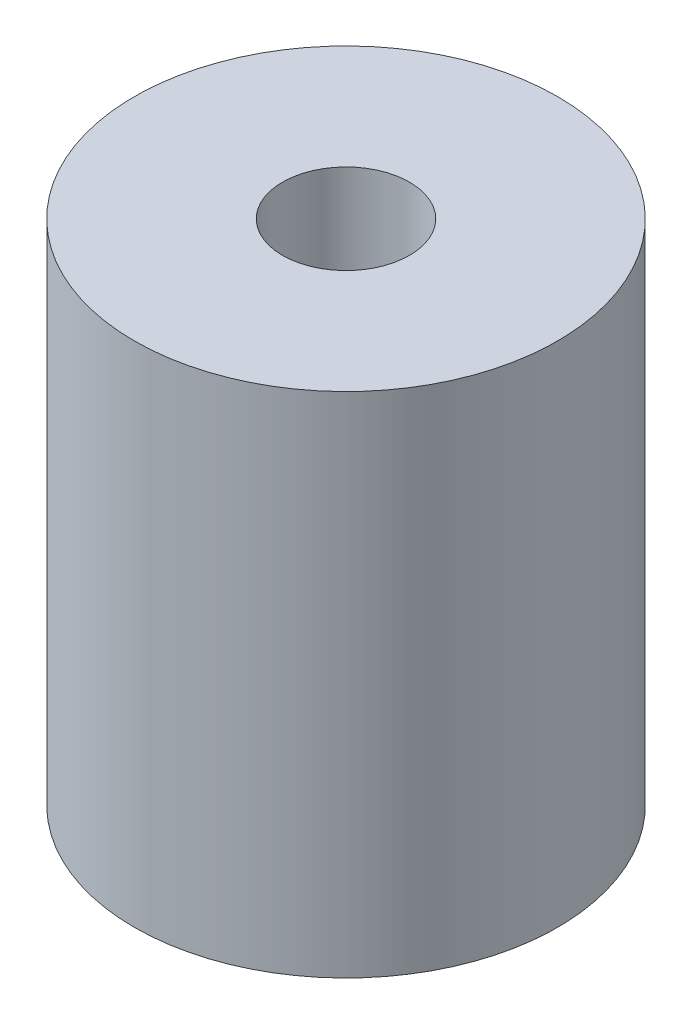
ISO-10303-21;
HEADER;
FILE_DESCRIPTION(('STEP AP214'),'2;1');
FILE_NAME('part.step','',(''),(''),'','','');
FILE_SCHEMA(('AUTOMOTIVE_DESIGN { 1 0 10303 214 1 1 1 1 }'));
ENDSEC;
DATA;
#1=APPLICATION_CONTEXT('core data for automotive mechanical design processes');
#2=APPLICATION_PROTOCOL_DEFINITION('international standard','automotive_design',2000,#1);
#3=PRODUCT_CONTEXT('',#1,'mechanical');
#4=PRODUCT('Part','Part','',(#3));
#5=PRODUCT_RELATED_PRODUCT_CATEGORY('part','',(#4));
#6=PRODUCT_DEFINITION_FORMATION('','',#4);
#7=PRODUCT_DEFINITION_CONTEXT('part definition',#1,'design');
#8=PRODUCT_DEFINITION('design','',#6,#7);
#9=PRODUCT_DEFINITION_SHAPE('','',#8);
#10=(LENGTH_UNIT() NAMED_UNIT(*) SI_UNIT(.MILLI.,.METRE.));
#11=(NAMED_UNIT(*) PLANE_ANGLE_UNIT() SI_UNIT($,.RADIAN.));
#12=(NAMED_UNIT(*) SI_UNIT($,.STERADIAN.) SOLID_ANGLE_UNIT());
#13=UNCERTAINTY_MEASURE_WITH_UNIT(LENGTH_MEASURE(1.E-05),#10,'distance_accuracy_value','');
#14=(GEOMETRIC_REPRESENTATION_CONTEXT(3) GLOBAL_UNCERTAINTY_ASSIGNED_CONTEXT((#13)) GLOBAL_UNIT_ASSIGNED_CONTEXT((#10,
#11,#12)) REPRESENTATION_CONTEXT('',''));
#15=CARTESIAN_POINT('',(0.,0.,0.));
#16=DIRECTION('',(0.,0.,1.));
#17=DIRECTION('',(1.,0.,0.));
#18=AXIS2_PLACEMENT_3D('',#15,#16,#17);
#19=CARTESIAN_POINT('',(0.,12.,0.));
#20=DIRECTION('',(0.,-1.,0.));
#21=DIRECTION('',(0.,0.,-1.));
#22=AXIS2_PLACEMENT_3D('',#19,#20,#21);
#23=CYLINDRICAL_SURFACE('',#22,5.);
#24=CARTESIAN_POINT('',(0.,12.,0.));
#25=DIRECTION('',(0.,1.,0.));
#26=DIRECTION('',(0.,0.,1.));
#27=AXIS2_PLACEMENT_3D('',#24,#25,#26);
#28=CIRCLE('',#27,5.);
#29=CARTESIAN_POINT('',(0.,12.,5.));
#30=VERTEX_POINT('',#29);
#31=EDGE_CURVE('E10',#30,#30,#28,.T.);
#32=ORIENTED_EDGE('',*,*,#31,.F.);
#33=EDGE_LOOP('',(#32));
#34=FACE_BOUND('',#33,.T.);
#35=CARTESIAN_POINT('',(0.,0.,0.));
#36=DIRECTION('',(0.,1.,0.));
#37=DIRECTION('',(0.,0.,1.));
#38=AXIS2_PLACEMENT_3D('',#35,#36,#37);
#39=CIRCLE('',#38,5.);
#40=CARTESIAN_POINT('',(0.,0.,5.));
#41=VERTEX_POINT('',#40);
#42=EDGE_CURVE('E33',#41,#41,#39,.T.);
#43=ORIENTED_EDGE('',*,*,#42,.T.);
#44=EDGE_LOOP('',(#43));
#45=FACE_BOUND('',#44,.T.);
#46=ADVANCED_FACE('F30',(#34,#45),#23,.T.);
#47=CARTESIAN_POINT('',(0.,12.,0.));
#48=DIRECTION('',(0.,1.,0.));
#49=DIRECTION('',(0.,0.,1.));
#50=AXIS2_PLACEMENT_3D('',#47,#48,#49);
#51=PLANE('',#50);
#52=CARTESIAN_POINT('',(0.,12.,0.));
#53=DIRECTION('',(0.,1.,0.));
#54=DIRECTION('',(0.,0.,1.));
#55=AXIS2_PLACEMENT_3D('',#52,#53,#54);
#56=CIRCLE('',#55,1.5);
#57=CARTESIAN_POINT('',(0.,12.,1.5));
#58=VERTEX_POINT('',#57);
#59=EDGE_CURVE('E42',#58,#58,#56,.T.);
#60=ORIENTED_EDGE('',*,*,#59,.F.);
#61=EDGE_LOOP('',(#60));
#62=FACE_BOUND('',#61,.T.);
#63=ORIENTED_EDGE('',*,*,#31,.T.);
#64=EDGE_LOOP('',(#63));
#65=FACE_BOUND('',#64,.T.);
#66=ADVANCED_FACE('F67',(#62,#65),#51,.T.);
#67=CARTESIAN_POINT('',(0.,0.,0.));
#68=DIRECTION('',(0.,1.,0.));
#69=DIRECTION('',(0.,0.,1.));
#70=AXIS2_PLACEMENT_3D('',#67,#68,#69);
#71=PLANE('',#70);
#72=CARTESIAN_POINT('',(0.,0.,0.));
#73=DIRECTION('',(0.,-1.,0.));
#74=DIRECTION('',(0.,0.,-1.));
#75=AXIS2_PLACEMENT_3D('',#72,#73,#74);
#76=CIRCLE('',#75,1.5);
#77=CARTESIAN_POINT('',(0.,0.,-1.5));
#78=VERTEX_POINT('',#77);
#79=EDGE_CURVE('E48',#78,#78,#76,.T.);
#80=ORIENTED_EDGE('',*,*,#79,.F.);
#81=EDGE_LOOP('',(#80));
#82=FACE_BOUND('',#81,.T.);
#83=ORIENTED_EDGE('',*,*,#42,.F.);
#84=EDGE_LOOP('',(#83));
#85=FACE_BOUND('',#84,.T.);
#86=ADVANCED_FACE('F63',(#82,#85),#71,.F.);
#87=CARTESIAN_POINT('',(0.,7.,0.));
#88=DIRECTION('',(0.,1.,0.));
#89=DIRECTION('',(0.,0.,1.));
#90=AXIS2_PLACEMENT_3D('',#87,#88,#89);
#91=CYLINDRICAL_SURFACE('',#90,1.5);
#92=CARTESIAN_POINT('',(0.,7.,0.));
#93=DIRECTION('',(0.,1.,0.));
#94=DIRECTION('',(0.,0.,1.));
#95=AXIS2_PLACEMENT_3D('',#92,#93,#94);
#96=CIRCLE('',#95,1.5);
#97=CARTESIAN_POINT('',(0.,7.,1.5));
#98=VERTEX_POINT('',#97);
#99=EDGE_CURVE('E40',#98,#98,#96,.T.);
#100=ORIENTED_EDGE('',*,*,#99,.F.);
#101=EDGE_LOOP('',(#100));
#102=FACE_BOUND('',#101,.T.);
#103=ORIENTED_EDGE('',*,*,#59,.T.);
#104=EDGE_LOOP('',(#103));
#105=FACE_BOUND('',#104,.T.);
#106=ADVANCED_FACE('F66',(#102,#105),#91,.F.);
#107=CARTESIAN_POINT('',(0.,7.,0.));
#108=DIRECTION('',(0.,1.,0.));
#109=DIRECTION('',(0.,0.,1.));
#110=AXIS2_PLACEMENT_3D('',#107,#108,#109);
#111=PLANE('',#110);
#112=ORIENTED_EDGE('',*,*,#99,.T.);
#113=EDGE_LOOP('',(#112));
#114=FACE_BOUND('',#113,.T.);
#115=ADVANCED_FACE('F59',(#114),#111,.T.);
#116=CARTESIAN_POINT('',(0.,5.,0.));
#117=DIRECTION('',(0.,-1.,0.));
#118=DIRECTION('',(0.,0.,-1.));
#119=AXIS2_PLACEMENT_3D('',#116,#117,#118);
#120=CYLINDRICAL_SURFACE('',#119,1.5);
#121=CARTESIAN_POINT('',(0.,5.,0.));
#122=DIRECTION('',(0.,-1.,0.));
#123=DIRECTION('',(0.,0.,-1.));
#124=AXIS2_PLACEMENT_3D('',#121,#122,#123);
#125=CIRCLE('',#124,1.5);
#126=CARTESIAN_POINT('',(0.,5.,-1.5));
#127=VERTEX_POINT('',#126);
#128=EDGE_CURVE('E45',#127,#127,#125,.T.);
#129=ORIENTED_EDGE('',*,*,#128,.F.);
#130=EDGE_LOOP('',(#129));
#131=FACE_BOUND('',#130,.T.);
#132=ORIENTED_EDGE('',*,*,#79,.T.);
#133=EDGE_LOOP('',(#132));
#134=FACE_BOUND('',#133,.T.);
#135=ADVANCED_FACE('F56',(#131,#134),#120,.F.);
#136=CARTESIAN_POINT('',(0.,5.,0.));
#137=DIRECTION('',(0.,-1.,0.));
#138=DIRECTION('',(0.,0.,-1.));
#139=AXIS2_PLACEMENT_3D('',#136,#137,#138);
#140=PLANE('',#139);
#141=ORIENTED_EDGE('',*,*,#128,.T.);
#142=EDGE_LOOP('',(#141));
#143=FACE_BOUND('',#142,.T.);
#144=ADVANCED_FACE('F54',(#143),#140,.T.);
#145=CLOSED_SHELL('',(#46,#66,#86,#106,#115,#135,#144));
#146=MANIFOLD_SOLID_BREP('B2',#145);
#147=ADVANCED_BREP_SHAPE_REPRESENTATION('',(#18,#146),#14);
#148=SHAPE_DEFINITION_REPRESENTATION(#9,#147);
ENDSEC;
END-ISO-10303-21;
